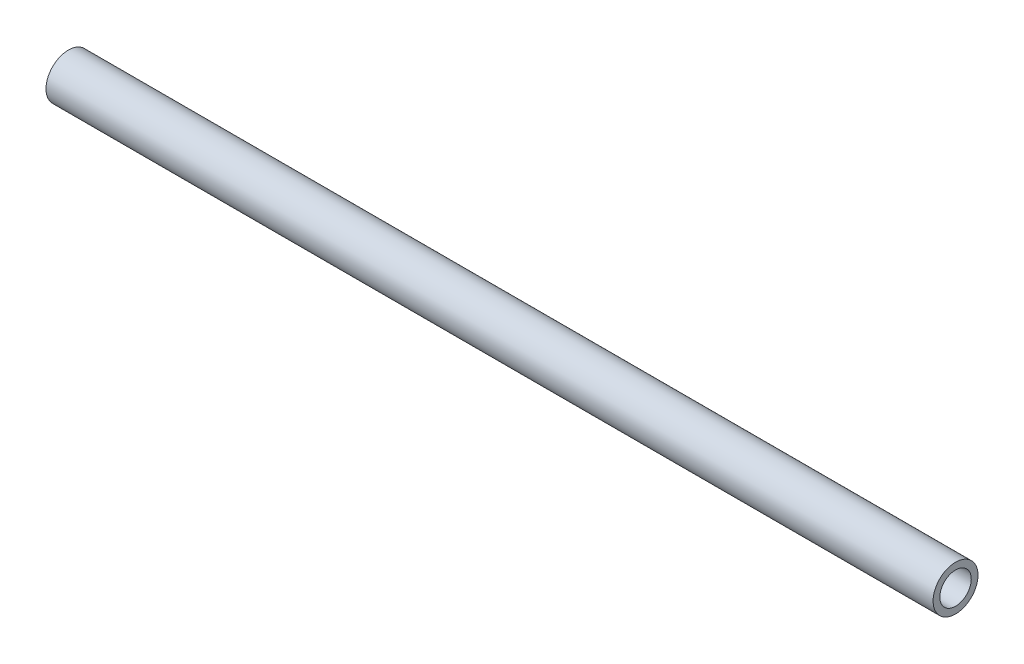
ISO-10303-21;
HEADER;
FILE_DESCRIPTION(('STEP AP214'),'2;1');
FILE_NAME('part.step','',(''),(''),'','','');
FILE_SCHEMA(('AUTOMOTIVE_DESIGN { 1 0 10303 214 1 1 1 1 }'));
ENDSEC;
DATA;
#1=APPLICATION_CONTEXT('core data for automotive mechanical design processes');
#2=APPLICATION_PROTOCOL_DEFINITION('international standard','automotive_design',2000,#1);
#3=PRODUCT_CONTEXT('',#1,'mechanical');
#4=PRODUCT('Part','Part','',(#3));
#5=PRODUCT_RELATED_PRODUCT_CATEGORY('part','',(#4));
#6=PRODUCT_DEFINITION_FORMATION('','',#4);
#7=PRODUCT_DEFINITION_CONTEXT('part definition',#1,'design');
#8=PRODUCT_DEFINITION('design','',#6,#7);
#9=PRODUCT_DEFINITION_SHAPE('','',#8);
#10=(LENGTH_UNIT() NAMED_UNIT(*) SI_UNIT(.MILLI.,.METRE.));
#11=(NAMED_UNIT(*) PLANE_ANGLE_UNIT() SI_UNIT($,.RADIAN.));
#12=(NAMED_UNIT(*) SI_UNIT($,.STERADIAN.) SOLID_ANGLE_UNIT());
#13=UNCERTAINTY_MEASURE_WITH_UNIT(LENGTH_MEASURE(1.E-05),#10,'distance_accuracy_value','');
#14=(GEOMETRIC_REPRESENTATION_CONTEXT(3) GLOBAL_UNCERTAINTY_ASSIGNED_CONTEXT((#13)) GLOBAL_UNIT_ASSIGNED_CONTEXT((#10,
#11,#12)) REPRESENTATION_CONTEXT('',''));
#15=CARTESIAN_POINT('',(0.,0.,0.));
#16=DIRECTION('',(0.,0.,1.));
#17=DIRECTION('',(1.,0.,0.));
#18=AXIS2_PLACEMENT_3D('',#15,#16,#17);
#19=CARTESIAN_POINT('',(0.,0.,0.));
#20=DIRECTION('',(1.,0.,0.));
#21=DIRECTION('',(0.,0.,-1.));
#22=AXIS2_PLACEMENT_3D('',#19,#20,#21);
#23=PLANE('',#22);
#24=CARTESIAN_POINT('',(0.,0.,0.));
#25=DIRECTION('',(1.,0.,0.));
#26=DIRECTION('',(0.,0.,-1.));
#27=AXIS2_PLACEMENT_3D('',#24,#25,#26);
#28=CIRCLE('',#27,7.);
#29=CARTESIAN_POINT('',(0.,0.,-7.));
#30=VERTEX_POINT('',#29);
#31=EDGE_CURVE('E55',#30,#30,#28,.T.);
#32=ORIENTED_EDGE('',*,*,#31,.T.);
#33=EDGE_LOOP('',(#32));
#34=FACE_BOUND('',#33,.T.);
#35=CARTESIAN_POINT('',(0.,0.,0.));
#36=DIRECTION('',(1.,0.,0.));
#37=DIRECTION('',(0.,0.,-1.));
#38=AXIS2_PLACEMENT_3D('',#35,#36,#37);
#39=CIRCLE('',#38,10.);
#40=CARTESIAN_POINT('',(0.,0.,-10.));
#41=VERTEX_POINT('',#40);
#42=EDGE_CURVE('E44',#41,#41,#39,.T.);
#43=ORIENTED_EDGE('',*,*,#42,.F.);
#44=EDGE_LOOP('',(#43));
#45=FACE_BOUND('',#44,.T.);
#46=ADVANCED_FACE('F40',(#34,#45),#23,.F.);
#47=CARTESIAN_POINT('',(395.,0.,0.));
#48=DIRECTION('',(1.,0.,0.));
#49=DIRECTION('',(0.,0.,-1.));
#50=AXIS2_PLACEMENT_3D('',#47,#48,#49);
#51=PLANE('',#50);
#52=CARTESIAN_POINT('',(395.,0.,0.));
#53=DIRECTION('',(1.,0.,0.));
#54=DIRECTION('',(0.,0.,-1.));
#55=AXIS2_PLACEMENT_3D('',#52,#53,#54);
#56=CIRCLE('',#55,7.);
#57=CARTESIAN_POINT('',(395.,0.,-7.));
#58=VERTEX_POINT('',#57);
#59=EDGE_CURVE('E51',#58,#58,#56,.T.);
#60=ORIENTED_EDGE('',*,*,#59,.F.);
#61=EDGE_LOOP('',(#60));
#62=FACE_BOUND('',#61,.T.);
#63=CARTESIAN_POINT('',(395.,0.,0.));
#64=DIRECTION('',(1.,0.,0.));
#65=DIRECTION('',(0.,0.,-1.));
#66=AXIS2_PLACEMENT_3D('',#63,#64,#65);
#67=CIRCLE('',#66,10.);
#68=CARTESIAN_POINT('',(395.,0.,-10.));
#69=VERTEX_POINT('',#68);
#70=EDGE_CURVE('E11',#69,#69,#67,.T.);
#71=ORIENTED_EDGE('',*,*,#70,.T.);
#72=EDGE_LOOP('',(#71));
#73=FACE_BOUND('',#72,.T.);
#74=ADVANCED_FACE('F68',(#62,#73),#51,.T.);
#75=CARTESIAN_POINT('',(0.,0.,0.));
#76=DIRECTION('',(1.,0.,0.));
#77=DIRECTION('',(0.,0.,-1.));
#78=AXIS2_PLACEMENT_3D('',#75,#76,#77);
#79=CYLINDRICAL_SURFACE('',#78,10.);
#80=ORIENTED_EDGE('',*,*,#70,.F.);
#81=EDGE_LOOP('',(#80));
#82=FACE_BOUND('',#81,.T.);
#83=ORIENTED_EDGE('',*,*,#42,.T.);
#84=EDGE_LOOP('',(#83));
#85=FACE_BOUND('',#84,.T.);
#86=ADVANCED_FACE('F42',(#82,#85),#79,.T.);
#87=CARTESIAN_POINT('',(0.,0.,0.));
#88=DIRECTION('',(1.,0.,0.));
#89=DIRECTION('',(0.,0.,-1.));
#90=AXIS2_PLACEMENT_3D('',#87,#88,#89);
#91=CYLINDRICAL_SURFACE('',#90,7.);
#92=ORIENTED_EDGE('',*,*,#59,.T.);
#93=EDGE_LOOP('',(#92));
#94=FACE_BOUND('',#93,.T.);
#95=ORIENTED_EDGE('',*,*,#31,.F.);
#96=EDGE_LOOP('',(#95));
#97=FACE_BOUND('',#96,.T.);
#98=ADVANCED_FACE('F61',(#94,#97),#91,.F.);
#99=CLOSED_SHELL('',(#46,#74,#86,#98));
#100=MANIFOLD_SOLID_BREP('B2',#99);
#101=ADVANCED_BREP_SHAPE_REPRESENTATION('',(#18,#100),#14);
#102=SHAPE_DEFINITION_REPRESENTATION(#9,#101);
ENDSEC;
END-ISO-10303-21;
